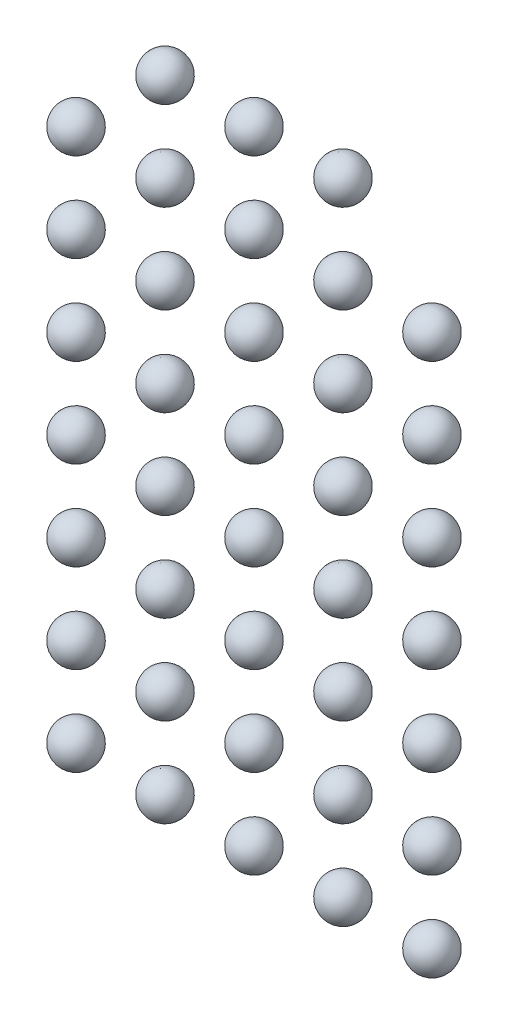
ISO-10303-21;
HEADER;
FILE_DESCRIPTION(('STEP AP214'),'2;1');
FILE_NAME('part.step','',(''),(''),'','','');
FILE_SCHEMA(('AUTOMOTIVE_DESIGN { 1 0 10303 214 1 1 1 1 }'));
ENDSEC;
DATA;
#1=APPLICATION_CONTEXT('core data for automotive mechanical design processes');
#2=APPLICATION_PROTOCOL_DEFINITION('international standard','automotive_design',2000,#1);
#3=PRODUCT_CONTEXT('',#1,'mechanical');
#4=PRODUCT('Part','Part','',(#3));
#5=PRODUCT_RELATED_PRODUCT_CATEGORY('part','',(#4));
#6=PRODUCT_DEFINITION_FORMATION('','',#4);
#7=PRODUCT_DEFINITION_CONTEXT('part definition',#1,'design');
#8=PRODUCT_DEFINITION('design','',#6,#7);
#9=PRODUCT_DEFINITION_SHAPE('','',#8);
#10=(LENGTH_UNIT() NAMED_UNIT(*) SI_UNIT(.MILLI.,.METRE.));
#11=(NAMED_UNIT(*) PLANE_ANGLE_UNIT() SI_UNIT($,.RADIAN.));
#12=(NAMED_UNIT(*) SI_UNIT($,.STERADIAN.) SOLID_ANGLE_UNIT());
#13=UNCERTAINTY_MEASURE_WITH_UNIT(LENGTH_MEASURE(1.E-05),#10,'distance_accuracy_value','');
#14=(GEOMETRIC_REPRESENTATION_CONTEXT(3) GLOBAL_UNCERTAINTY_ASSIGNED_CONTEXT((#13)) GLOBAL_UNIT_ASSIGNED_CONTEXT((#10,
#11,#12)) REPRESENTATION_CONTEXT('',''));
#15=CARTESIAN_POINT('',(0.,0.,0.));
#16=DIRECTION('',(0.,0.,1.));
#17=DIRECTION('',(1.,0.,0.));
#18=AXIS2_PLACEMENT_3D('',#15,#16,#17);
#19=CARTESIAN_POINT('',(12.,18.,0.));
#20=DIRECTION('',(-1.,0.,0.));
#21=DIRECTION('',(0.,1.,0.));
#22=AXIS2_PLACEMENT_3D('',#19,#20,#21);
#23=SPHERICAL_SURFACE('',#22,0.7);
#24=CARTESIAN_POINT('',(11.3,18.,0.));
#25=VERTEX_POINT('',#24);
#26=VERTEX_LOOP('',#25);
#27=FACE_BOUND('',#26,.T.);
#28=ADVANCED_FACE('F44',(#27),#23,.T.);
#29=CLOSED_SHELL('',(#28));
#30=MANIFOLD_SOLID_BREP('B2',#29);
#31=CARTESIAN_POINT('',(12.,15.,0.));
#32=DIRECTION('',(-1.,0.,0.));
#33=DIRECTION('',(0.,1.,0.));
#34=AXIS2_PLACEMENT_3D('',#31,#32,#33);
#35=SPHERICAL_SURFACE('',#34,0.7);
#36=CARTESIAN_POINT('',(11.3,15.,0.));
#37=VERTEX_POINT('',#36);
#38=VERTEX_LOOP('',#37);
#39=FACE_BOUND('',#38,.T.);
#40=ADVANCED_FACE('F65',(#39),#35,.T.);
#41=CLOSED_SHELL('',(#40));
#42=MANIFOLD_SOLID_BREP('B6',#41);
#43=CARTESIAN_POINT('',(9.,21.,0.));
#44=DIRECTION('',(-1.,0.,0.));
#45=DIRECTION('',(0.,1.,0.));
#46=AXIS2_PLACEMENT_3D('',#43,#44,#45);
#47=SPHERICAL_SURFACE('',#46,0.7);
#48=CARTESIAN_POINT('',(8.3,21.,0.));
#49=VERTEX_POINT('',#48);
#50=VERTEX_LOOP('',#49);
#51=FACE_BOUND('',#50,.T.);
#52=ADVANCED_FACE('F86',(#51),#47,.T.);
#53=CLOSED_SHELL('',(#52));
#54=MANIFOLD_SOLID_BREP('B40',#53);
#55=CARTESIAN_POINT('',(9.,18.,0.));
#56=DIRECTION('',(-1.,0.,0.));
#57=DIRECTION('',(0.,1.,0.));
#58=AXIS2_PLACEMENT_3D('',#55,#56,#57);
#59=SPHERICAL_SURFACE('',#58,0.7);
#60=CARTESIAN_POINT('',(8.3,18.,0.));
#61=VERTEX_POINT('',#60);
#62=VERTEX_LOOP('',#61);
#63=FACE_BOUND('',#62,.T.);
#64=ADVANCED_FACE('F107',(#63),#59,.T.);
#65=CLOSED_SHELL('',(#64));
#66=MANIFOLD_SOLID_BREP('B61',#65);
#67=CARTESIAN_POINT('',(9.,15.,0.));
#68=DIRECTION('',(-1.,0.,0.));
#69=DIRECTION('',(0.,1.,0.));
#70=AXIS2_PLACEMENT_3D('',#67,#68,#69);
#71=SPHERICAL_SURFACE('',#70,0.7);
#72=CARTESIAN_POINT('',(8.3,15.,0.));
#73=VERTEX_POINT('',#72);
#74=VERTEX_LOOP('',#73);
#75=FACE_BOUND('',#74,.T.);
#76=ADVANCED_FACE('F128',(#75),#71,.T.);
#77=CLOSED_SHELL('',(#76));
#78=MANIFOLD_SOLID_BREP('B82',#77);
#79=CARTESIAN_POINT('',(6.,21.,0.));
#80=DIRECTION('',(-1.,0.,0.));
#81=DIRECTION('',(0.,1.,0.));
#82=AXIS2_PLACEMENT_3D('',#79,#80,#81);
#83=SPHERICAL_SURFACE('',#82,0.7);
#84=CARTESIAN_POINT('',(5.3,21.,0.));
#85=VERTEX_POINT('',#84);
#86=VERTEX_LOOP('',#85);
#87=FACE_BOUND('',#86,.T.);
#88=ADVANCED_FACE('F149',(#87),#83,.T.);
#89=CLOSED_SHELL('',(#88));
#90=MANIFOLD_SOLID_BREP('B103',#89);
#91=CARTESIAN_POINT('',(6.,18.,0.));
#92=DIRECTION('',(-1.,0.,0.));
#93=DIRECTION('',(0.,1.,0.));
#94=AXIS2_PLACEMENT_3D('',#91,#92,#93);
#95=SPHERICAL_SURFACE('',#94,0.7);
#96=CARTESIAN_POINT('',(5.3,18.,0.));
#97=VERTEX_POINT('',#96);
#98=VERTEX_LOOP('',#97);
#99=FACE_BOUND('',#98,.T.);
#100=ADVANCED_FACE('F170',(#99),#95,.T.);
#101=CLOSED_SHELL('',(#100));
#102=MANIFOLD_SOLID_BREP('B124',#101);
#103=CARTESIAN_POINT('',(6.,15.,0.));
#104=DIRECTION('',(-1.,0.,0.));
#105=DIRECTION('',(0.,1.,0.));
#106=AXIS2_PLACEMENT_3D('',#103,#104,#105);
#107=SPHERICAL_SURFACE('',#106,0.7);
#108=CARTESIAN_POINT('',(5.3,15.,0.));
#109=VERTEX_POINT('',#108);
#110=VERTEX_LOOP('',#109);
#111=FACE_BOUND('',#110,.T.);
#112=ADVANCED_FACE('F191',(#111),#107,.T.);
#113=CLOSED_SHELL('',(#112));
#114=MANIFOLD_SOLID_BREP('B145',#113);
#115=CARTESIAN_POINT('',(3.,21.,0.));
#116=DIRECTION('',(-1.,0.,0.));
#117=DIRECTION('',(0.,1.,0.));
#118=AXIS2_PLACEMENT_3D('',#115,#116,#117);
#119=SPHERICAL_SURFACE('',#118,0.7);
#120=CARTESIAN_POINT('',(2.3,21.,0.));
#121=VERTEX_POINT('',#120);
#122=VERTEX_LOOP('',#121);
#123=FACE_BOUND('',#122,.T.);
#124=ADVANCED_FACE('F212',(#123),#119,.T.);
#125=CLOSED_SHELL('',(#124));
#126=MANIFOLD_SOLID_BREP('B166',#125);
#127=CARTESIAN_POINT('',(3.,18.,0.));
#128=DIRECTION('',(-1.,0.,0.));
#129=DIRECTION('',(0.,1.,0.));
#130=AXIS2_PLACEMENT_3D('',#127,#128,#129);
#131=SPHERICAL_SURFACE('',#130,0.7);
#132=CARTESIAN_POINT('',(2.3,18.,0.));
#133=VERTEX_POINT('',#132);
#134=VERTEX_LOOP('',#133);
#135=FACE_BOUND('',#134,.T.);
#136=ADVANCED_FACE('F233',(#135),#131,.T.);
#137=CLOSED_SHELL('',(#136));
#138=MANIFOLD_SOLID_BREP('B187',#137);
#139=CARTESIAN_POINT('',(3.,15.,0.));
#140=DIRECTION('',(-1.,0.,0.));
#141=DIRECTION('',(0.,1.,0.));
#142=AXIS2_PLACEMENT_3D('',#139,#140,#141);
#143=SPHERICAL_SURFACE('',#142,0.7);
#144=CARTESIAN_POINT('',(2.3,15.,0.));
#145=VERTEX_POINT('',#144);
#146=VERTEX_LOOP('',#145);
#147=FACE_BOUND('',#146,.T.);
#148=ADVANCED_FACE('F254',(#147),#143,.T.);
#149=CLOSED_SHELL('',(#148));
#150=MANIFOLD_SOLID_BREP('B208',#149);
#151=CARTESIAN_POINT('',(0.,18.,0.));
#152=DIRECTION('',(-1.,0.,0.));
#153=DIRECTION('',(0.,1.,0.));
#154=AXIS2_PLACEMENT_3D('',#151,#152,#153);
#155=SPHERICAL_SURFACE('',#154,0.7);
#156=CARTESIAN_POINT('',(-0.7,18.,0.));
#157=VERTEX_POINT('',#156);
#158=VERTEX_LOOP('',#157);
#159=FACE_BOUND('',#158,.T.);
#160=ADVANCED_FACE('F275',(#159),#155,.T.);
#161=CLOSED_SHELL('',(#160));
#162=MANIFOLD_SOLID_BREP('B229',#161);
#163=CARTESIAN_POINT('',(12.,15.,0.));
#164=DIRECTION('',(-1.,0.,0.));
#165=DIRECTION('',(0.,1.,0.));
#166=AXIS2_PLACEMENT_3D('',#163,#164,#165);
#167=SPHERICAL_SURFACE('',#166,0.7);
#168=CARTESIAN_POINT('',(11.3,15.,0.));
#169=VERTEX_POINT('',#168);
#170=VERTEX_LOOP('',#169);
#171=FACE_BOUND('',#170,.T.);
#172=ADVANCED_FACE('F296',(#171),#167,.T.);
#173=CLOSED_SHELL('',(#172));
#174=MANIFOLD_SOLID_BREP('B250',#173);
#175=CARTESIAN_POINT('',(9.,15.,0.));
#176=DIRECTION('',(-1.,0.,0.));
#177=DIRECTION('',(0.,1.,0.));
#178=AXIS2_PLACEMENT_3D('',#175,#176,#177);
#179=SPHERICAL_SURFACE('',#178,0.7);
#180=CARTESIAN_POINT('',(8.3,15.,0.));
#181=VERTEX_POINT('',#180);
#182=VERTEX_LOOP('',#181);
#183=FACE_BOUND('',#182,.T.);
#184=ADVANCED_FACE('F317',(#183),#179,.T.);
#185=CLOSED_SHELL('',(#184));
#186=MANIFOLD_SOLID_BREP('B271',#185);
#187=CARTESIAN_POINT('',(6.,15.,0.));
#188=DIRECTION('',(-1.,0.,0.));
#189=DIRECTION('',(0.,1.,0.));
#190=AXIS2_PLACEMENT_3D('',#187,#188,#189);
#191=SPHERICAL_SURFACE('',#190,0.7);
#192=CARTESIAN_POINT('',(5.3,15.,0.));
#193=VERTEX_POINT('',#192);
#194=VERTEX_LOOP('',#193);
#195=FACE_BOUND('',#194,.T.);
#196=ADVANCED_FACE('F338',(#195),#191,.T.);
#197=CLOSED_SHELL('',(#196));
#198=MANIFOLD_SOLID_BREP('B292',#197);
#199=CARTESIAN_POINT('',(3.,15.,0.));
#200=DIRECTION('',(-1.,0.,0.));
#201=DIRECTION('',(0.,1.,0.));
#202=AXIS2_PLACEMENT_3D('',#199,#200,#201);
#203=SPHERICAL_SURFACE('',#202,0.7);
#204=CARTESIAN_POINT('',(2.3,15.,0.));
#205=VERTEX_POINT('',#204);
#206=VERTEX_LOOP('',#205);
#207=FACE_BOUND('',#206,.T.);
#208=ADVANCED_FACE('F359',(#207),#203,.T.);
#209=CLOSED_SHELL('',(#208));
#210=MANIFOLD_SOLID_BREP('B313',#209);
#211=CARTESIAN_POINT('',(0.,15.,0.));
#212=DIRECTION('',(-1.,0.,0.));
#213=DIRECTION('',(0.,1.,0.));
#214=AXIS2_PLACEMENT_3D('',#211,#212,#213);
#215=SPHERICAL_SURFACE('',#214,0.7);
#216=CARTESIAN_POINT('',(-0.7,15.,0.));
#217=VERTEX_POINT('',#216);
#218=VERTEX_LOOP('',#217);
#219=FACE_BOUND('',#218,.T.);
#220=ADVANCED_FACE('F380',(#219),#215,.T.);
#221=CLOSED_SHELL('',(#220));
#222=MANIFOLD_SOLID_BREP('B334',#221);
#223=CARTESIAN_POINT('',(12.,12.,0.));
#224=DIRECTION('',(-1.,0.,0.));
#225=DIRECTION('',(0.,1.,0.));
#226=AXIS2_PLACEMENT_3D('',#223,#224,#225);
#227=SPHERICAL_SURFACE('',#226,0.7);
#228=CARTESIAN_POINT('',(11.3,12.,0.));
#229=VERTEX_POINT('',#228);
#230=VERTEX_LOOP('',#229);
#231=FACE_BOUND('',#230,.T.);
#232=ADVANCED_FACE('F401',(#231),#227,.T.);
#233=CLOSED_SHELL('',(#232));
#234=MANIFOLD_SOLID_BREP('B355',#233);
#235=CARTESIAN_POINT('',(9.,12.,0.));
#236=DIRECTION('',(-1.,0.,0.));
#237=DIRECTION('',(0.,1.,0.));
#238=AXIS2_PLACEMENT_3D('',#235,#236,#237);
#239=SPHERICAL_SURFACE('',#238,0.7);
#240=CARTESIAN_POINT('',(8.3,12.,0.));
#241=VERTEX_POINT('',#240);
#242=VERTEX_LOOP('',#241);
#243=FACE_BOUND('',#242,.T.);
#244=ADVANCED_FACE('F422',(#243),#239,.T.);
#245=CLOSED_SHELL('',(#244));
#246=MANIFOLD_SOLID_BREP('B376',#245);
#247=CARTESIAN_POINT('',(6.,12.,0.));
#248=DIRECTION('',(-1.,0.,0.));
#249=DIRECTION('',(0.,1.,0.));
#250=AXIS2_PLACEMENT_3D('',#247,#248,#249);
#251=SPHERICAL_SURFACE('',#250,0.7);
#252=CARTESIAN_POINT('',(5.3,12.,0.));
#253=VERTEX_POINT('',#252);
#254=VERTEX_LOOP('',#253);
#255=FACE_BOUND('',#254,.T.);
#256=ADVANCED_FACE('F443',(#255),#251,.T.);
#257=CLOSED_SHELL('',(#256));
#258=MANIFOLD_SOLID_BREP('B397',#257);
#259=CARTESIAN_POINT('',(3.,12.,0.));
#260=DIRECTION('',(-1.,0.,0.));
#261=DIRECTION('',(0.,1.,0.));
#262=AXIS2_PLACEMENT_3D('',#259,#260,#261);
#263=SPHERICAL_SURFACE('',#262,0.7);
#264=CARTESIAN_POINT('',(2.3,12.,0.));
#265=VERTEX_POINT('',#264);
#266=VERTEX_LOOP('',#265);
#267=FACE_BOUND('',#266,.T.);
#268=ADVANCED_FACE('F464',(#267),#263,.T.);
#269=CLOSED_SHELL('',(#268));
#270=MANIFOLD_SOLID_BREP('B418',#269);
#271=CARTESIAN_POINT('',(0.,12.,0.));
#272=DIRECTION('',(-1.,0.,0.));
#273=DIRECTION('',(0.,1.,0.));
#274=AXIS2_PLACEMENT_3D('',#271,#272,#273);
#275=SPHERICAL_SURFACE('',#274,0.7);
#276=CARTESIAN_POINT('',(-0.7,12.,0.));
#277=VERTEX_POINT('',#276);
#278=VERTEX_LOOP('',#277);
#279=FACE_BOUND('',#278,.T.);
#280=ADVANCED_FACE('F485',(#279),#275,.T.);
#281=CLOSED_SHELL('',(#280));
#282=MANIFOLD_SOLID_BREP('B439',#281);
#283=CARTESIAN_POINT('',(12.,9.,0.));
#284=DIRECTION('',(-1.,0.,0.));
#285=DIRECTION('',(0.,1.,0.));
#286=AXIS2_PLACEMENT_3D('',#283,#284,#285);
#287=SPHERICAL_SURFACE('',#286,0.7);
#288=CARTESIAN_POINT('',(11.3,9.,0.));
#289=VERTEX_POINT('',#288);
#290=VERTEX_LOOP('',#289);
#291=FACE_BOUND('',#290,.T.);
#292=ADVANCED_FACE('F506',(#291),#287,.T.);
#293=CLOSED_SHELL('',(#292));
#294=MANIFOLD_SOLID_BREP('B460',#293);
#295=CARTESIAN_POINT('',(9.,9.,0.));
#296=DIRECTION('',(-1.,0.,0.));
#297=DIRECTION('',(0.,1.,0.));
#298=AXIS2_PLACEMENT_3D('',#295,#296,#297);
#299=SPHERICAL_SURFACE('',#298,0.7);
#300=CARTESIAN_POINT('',(8.3,9.,0.));
#301=VERTEX_POINT('',#300);
#302=VERTEX_LOOP('',#301);
#303=FACE_BOUND('',#302,.T.);
#304=ADVANCED_FACE('F527',(#303),#299,.T.);
#305=CLOSED_SHELL('',(#304));
#306=MANIFOLD_SOLID_BREP('B481',#305);
#307=CARTESIAN_POINT('',(6.,9.,0.));
#308=DIRECTION('',(-1.,0.,0.));
#309=DIRECTION('',(0.,1.,0.));
#310=AXIS2_PLACEMENT_3D('',#307,#308,#309);
#311=SPHERICAL_SURFACE('',#310,0.7);
#312=CARTESIAN_POINT('',(5.3,9.,0.));
#313=VERTEX_POINT('',#312);
#314=VERTEX_LOOP('',#313);
#315=FACE_BOUND('',#314,.T.);
#316=ADVANCED_FACE('F548',(#315),#311,.T.);
#317=CLOSED_SHELL('',(#316));
#318=MANIFOLD_SOLID_BREP('B502',#317);
#319=CARTESIAN_POINT('',(3.,9.,0.));
#320=DIRECTION('',(-1.,0.,0.));
#321=DIRECTION('',(0.,1.,0.));
#322=AXIS2_PLACEMENT_3D('',#319,#320,#321);
#323=SPHERICAL_SURFACE('',#322,0.7);
#324=CARTESIAN_POINT('',(2.3,9.,0.));
#325=VERTEX_POINT('',#324);
#326=VERTEX_LOOP('',#325);
#327=FACE_BOUND('',#326,.T.);
#328=ADVANCED_FACE('F569',(#327),#323,.T.);
#329=CLOSED_SHELL('',(#328));
#330=MANIFOLD_SOLID_BREP('B523',#329);
#331=CARTESIAN_POINT('',(0.,9.,0.));
#332=DIRECTION('',(-1.,0.,0.));
#333=DIRECTION('',(0.,1.,0.));
#334=AXIS2_PLACEMENT_3D('',#331,#332,#333);
#335=SPHERICAL_SURFACE('',#334,0.7);
#336=CARTESIAN_POINT('',(-0.7,9.,0.));
#337=VERTEX_POINT('',#336);
#338=VERTEX_LOOP('',#337);
#339=FACE_BOUND('',#338,.T.);
#340=ADVANCED_FACE('F590',(#339),#335,.T.);
#341=CLOSED_SHELL('',(#340));
#342=MANIFOLD_SOLID_BREP('B544',#341);
#343=CARTESIAN_POINT('',(12.,6.,0.));
#344=DIRECTION('',(-1.,0.,0.));
#345=DIRECTION('',(0.,1.,0.));
#346=AXIS2_PLACEMENT_3D('',#343,#344,#345);
#347=SPHERICAL_SURFACE('',#346,0.7);
#348=CARTESIAN_POINT('',(11.3,6.,0.));
#349=VERTEX_POINT('',#348);
#350=VERTEX_LOOP('',#349);
#351=FACE_BOUND('',#350,.T.);
#352=ADVANCED_FACE('F611',(#351),#347,.T.);
#353=CLOSED_SHELL('',(#352));
#354=MANIFOLD_SOLID_BREP('B565',#353);
#355=CARTESIAN_POINT('',(9.,6.,0.));
#356=DIRECTION('',(-1.,0.,0.));
#357=DIRECTION('',(0.,1.,0.));
#358=AXIS2_PLACEMENT_3D('',#355,#356,#357);
#359=SPHERICAL_SURFACE('',#358,0.7);
#360=CARTESIAN_POINT('',(8.3,6.,0.));
#361=VERTEX_POINT('',#360);
#362=VERTEX_LOOP('',#361);
#363=FACE_BOUND('',#362,.T.);
#364=ADVANCED_FACE('F632',(#363),#359,.T.);
#365=CLOSED_SHELL('',(#364));
#366=MANIFOLD_SOLID_BREP('B586',#365);
#367=CARTESIAN_POINT('',(6.,6.,0.));
#368=DIRECTION('',(-1.,0.,0.));
#369=DIRECTION('',(0.,1.,0.));
#370=AXIS2_PLACEMENT_3D('',#367,#368,#369);
#371=SPHERICAL_SURFACE('',#370,0.7);
#372=CARTESIAN_POINT('',(5.3,6.,0.));
#373=VERTEX_POINT('',#372);
#374=VERTEX_LOOP('',#373);
#375=FACE_BOUND('',#374,.T.);
#376=ADVANCED_FACE('F653',(#375),#371,.T.);
#377=CLOSED_SHELL('',(#376));
#378=MANIFOLD_SOLID_BREP('B607',#377);
#379=CARTESIAN_POINT('',(3.,6.,0.));
#380=DIRECTION('',(-1.,0.,0.));
#381=DIRECTION('',(0.,1.,0.));
#382=AXIS2_PLACEMENT_3D('',#379,#380,#381);
#383=SPHERICAL_SURFACE('',#382,0.7);
#384=CARTESIAN_POINT('',(2.3,6.,0.));
#385=VERTEX_POINT('',#384);
#386=VERTEX_LOOP('',#385);
#387=FACE_BOUND('',#386,.T.);
#388=ADVANCED_FACE('F674',(#387),#383,.T.);
#389=CLOSED_SHELL('',(#388));
#390=MANIFOLD_SOLID_BREP('B628',#389);
#391=CARTESIAN_POINT('',(0.,6.,0.));
#392=DIRECTION('',(-1.,0.,0.));
#393=DIRECTION('',(0.,1.,0.));
#394=AXIS2_PLACEMENT_3D('',#391,#392,#393);
#395=SPHERICAL_SURFACE('',#394,0.7);
#396=CARTESIAN_POINT('',(-0.7,6.,0.));
#397=VERTEX_POINT('',#396);
#398=VERTEX_LOOP('',#397);
#399=FACE_BOUND('',#398,.T.);
#400=ADVANCED_FACE('F695',(#399),#395,.T.);
#401=CLOSED_SHELL('',(#400));
#402=MANIFOLD_SOLID_BREP('B649',#401);
#403=CARTESIAN_POINT('',(12.,3.,0.));
#404=DIRECTION('',(-1.,0.,0.));
#405=DIRECTION('',(0.,1.,0.));
#406=AXIS2_PLACEMENT_3D('',#403,#404,#405);
#407=SPHERICAL_SURFACE('',#406,0.7);
#408=CARTESIAN_POINT('',(11.3,3.,0.));
#409=VERTEX_POINT('',#408);
#410=VERTEX_LOOP('',#409);
#411=FACE_BOUND('',#410,.T.);
#412=ADVANCED_FACE('F716',(#411),#407,.T.);
#413=CLOSED_SHELL('',(#412));
#414=MANIFOLD_SOLID_BREP('B670',#413);
#415=CARTESIAN_POINT('',(9.,3.,0.));
#416=DIRECTION('',(-1.,0.,0.));
#417=DIRECTION('',(0.,1.,0.));
#418=AXIS2_PLACEMENT_3D('',#415,#416,#417);
#419=SPHERICAL_SURFACE('',#418,0.7);
#420=CARTESIAN_POINT('',(8.3,3.,0.));
#421=VERTEX_POINT('',#420);
#422=VERTEX_LOOP('',#421);
#423=FACE_BOUND('',#422,.T.);
#424=ADVANCED_FACE('F737',(#423),#419,.T.);
#425=CLOSED_SHELL('',(#424));
#426=MANIFOLD_SOLID_BREP('B691',#425);
#427=CARTESIAN_POINT('',(6.,3.,0.));
#428=DIRECTION('',(-1.,0.,0.));
#429=DIRECTION('',(0.,1.,0.));
#430=AXIS2_PLACEMENT_3D('',#427,#428,#429);
#431=SPHERICAL_SURFACE('',#430,0.7);
#432=CARTESIAN_POINT('',(5.3,3.,0.));
#433=VERTEX_POINT('',#432);
#434=VERTEX_LOOP('',#433);
#435=FACE_BOUND('',#434,.T.);
#436=ADVANCED_FACE('F758',(#435),#431,.T.);
#437=CLOSED_SHELL('',(#436));
#438=MANIFOLD_SOLID_BREP('B712',#437);
#439=CARTESIAN_POINT('',(3.,3.,0.));
#440=DIRECTION('',(-1.,0.,0.));
#441=DIRECTION('',(0.,1.,0.));
#442=AXIS2_PLACEMENT_3D('',#439,#440,#441);
#443=SPHERICAL_SURFACE('',#442,0.7);
#444=CARTESIAN_POINT('',(2.3,3.,0.));
#445=VERTEX_POINT('',#444);
#446=VERTEX_LOOP('',#445);
#447=FACE_BOUND('',#446,.T.);
#448=ADVANCED_FACE('F779',(#447),#443,.T.);
#449=CLOSED_SHELL('',(#448));
#450=MANIFOLD_SOLID_BREP('B733',#449);
#451=CARTESIAN_POINT('',(0.,3.,0.));
#452=DIRECTION('',(-1.,0.,0.));
#453=DIRECTION('',(0.,1.,0.));
#454=AXIS2_PLACEMENT_3D('',#451,#452,#453);
#455=SPHERICAL_SURFACE('',#454,0.7);
#456=CARTESIAN_POINT('',(-0.7,3.,0.));
#457=VERTEX_POINT('',#456);
#458=VERTEX_LOOP('',#457);
#459=FACE_BOUND('',#458,.T.);
#460=ADVANCED_FACE('F800',(#459),#455,.T.);
#461=CLOSED_SHELL('',(#460));
#462=MANIFOLD_SOLID_BREP('B754',#461);
#463=CARTESIAN_POINT('',(12.,0.,0.));
#464=DIRECTION('',(-1.,0.,0.));
#465=DIRECTION('',(0.,1.,0.));
#466=AXIS2_PLACEMENT_3D('',#463,#464,#465);
#467=SPHERICAL_SURFACE('',#466,0.7);
#468=CARTESIAN_POINT('',(11.3,0.,0.));
#469=VERTEX_POINT('',#468);
#470=VERTEX_LOOP('',#469);
#471=FACE_BOUND('',#470,.T.);
#472=ADVANCED_FACE('F821',(#471),#467,.T.);
#473=CLOSED_SHELL('',(#472));
#474=MANIFOLD_SOLID_BREP('B775',#473);
#475=CARTESIAN_POINT('',(9.,0.,0.));
#476=DIRECTION('',(-1.,0.,0.));
#477=DIRECTION('',(0.,1.,0.));
#478=AXIS2_PLACEMENT_3D('',#475,#476,#477);
#479=SPHERICAL_SURFACE('',#478,0.7);
#480=CARTESIAN_POINT('',(8.3,0.,0.));
#481=VERTEX_POINT('',#480);
#482=VERTEX_LOOP('',#481);
#483=FACE_BOUND('',#482,.T.);
#484=ADVANCED_FACE('F842',(#483),#479,.T.);
#485=CLOSED_SHELL('',(#484));
#486=MANIFOLD_SOLID_BREP('B796',#485);
#487=CARTESIAN_POINT('',(6.,0.,0.));
#488=DIRECTION('',(-1.,0.,0.));
#489=DIRECTION('',(0.,1.,0.));
#490=AXIS2_PLACEMENT_3D('',#487,#488,#489);
#491=SPHERICAL_SURFACE('',#490,0.7);
#492=CARTESIAN_POINT('',(5.3,0.,0.));
#493=VERTEX_POINT('',#492);
#494=VERTEX_LOOP('',#493);
#495=FACE_BOUND('',#494,.T.);
#496=ADVANCED_FACE('F863',(#495),#491,.T.);
#497=CLOSED_SHELL('',(#496));
#498=MANIFOLD_SOLID_BREP('B817',#497);
#499=CARTESIAN_POINT('',(3.,0.,0.));
#500=DIRECTION('',(-1.,0.,0.));
#501=DIRECTION('',(0.,1.,0.));
#502=AXIS2_PLACEMENT_3D('',#499,#500,#501);
#503=SPHERICAL_SURFACE('',#502,0.7);
#504=CARTESIAN_POINT('',(2.3,0.,0.));
#505=VERTEX_POINT('',#504);
#506=VERTEX_LOOP('',#505);
#507=FACE_BOUND('',#506,.T.);
#508=ADVANCED_FACE('F883',(#507),#503,.T.);
#509=CLOSED_SHELL('',(#508));
#510=MANIFOLD_SOLID_BREP('B838',#509);
#511=CARTESIAN_POINT('',(0.,0.,0.));
#512=DIRECTION('',(-1.,0.,0.));
#513=DIRECTION('',(0.,1.,0.));
#514=AXIS2_PLACEMENT_3D('',#511,#512,#513);
#515=SPHERICAL_SURFACE('',#514,0.7);
#516=CARTESIAN_POINT('',(-0.7,0.,0.));
#517=VERTEX_POINT('',#516);
#518=VERTEX_LOOP('',#517);
#519=FACE_BOUND('',#518,.T.);
#520=ADVANCED_FACE('F898',(#519),#515,.T.);
#521=CLOSED_SHELL('',(#520));
#522=MANIFOLD_SOLID_BREP('B859',#521);
#523=ADVANCED_BREP_SHAPE_REPRESENTATION('',(#18,#30,#42,#54,#66,#78,#90,#102,#114,#126,#138,
#150,#162,#174,#186,#198,#210,#222,#234,#246,#258,#270,#282,#294,#306,#318,#330,#342,#354,#366,
#378,#390,#402,#414,#426,#438,#450,#462,#474,#486,#498,#510,#522),#14);
#524=SHAPE_DEFINITION_REPRESENTATION(#9,#523);
ENDSEC;
END-ISO-10303-21;
